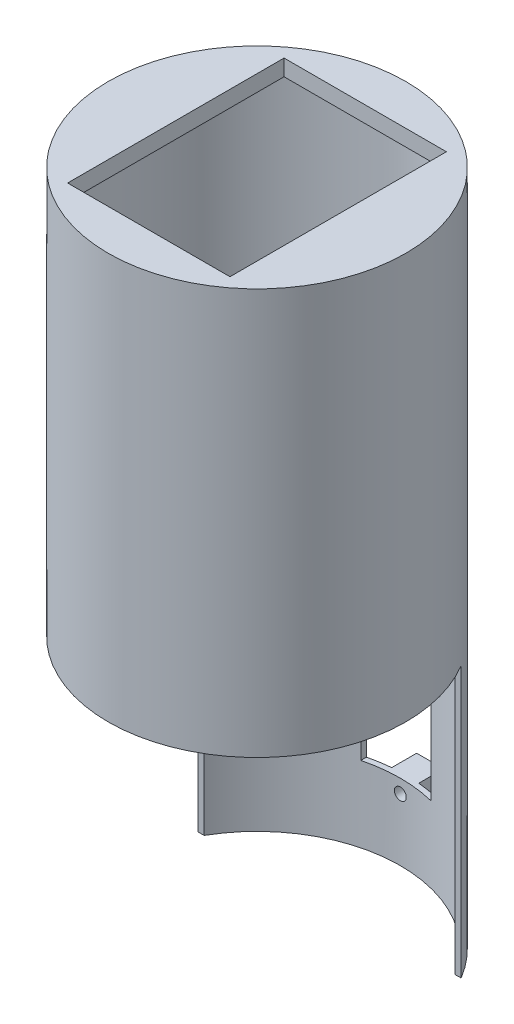
ISO-10303-21;
HEADER;
FILE_DESCRIPTION(('STEP AP214'),'2;1');
FILE_NAME('part.step','',(''),(''),'','','');
FILE_SCHEMA(('AUTOMOTIVE_DESIGN { 1 0 10303 214 1 1 1 1 }'));
ENDSEC;
DATA;
#1=APPLICATION_CONTEXT('core data for automotive mechanical design processes');
#2=APPLICATION_PROTOCOL_DEFINITION('international standard','automotive_design',2000,#1);
#3=PRODUCT_CONTEXT('',#1,'mechanical');
#4=PRODUCT('Part','Part','',(#3));
#5=PRODUCT_RELATED_PRODUCT_CATEGORY('part','',(#4));
#6=PRODUCT_DEFINITION_FORMATION('','',#4);
#7=PRODUCT_DEFINITION_CONTEXT('part definition',#1,'design');
#8=PRODUCT_DEFINITION('design','',#6,#7);
#9=PRODUCT_DEFINITION_SHAPE('','',#8);
#10=(LENGTH_UNIT() NAMED_UNIT(*) SI_UNIT(.MILLI.,.METRE.));
#11=(NAMED_UNIT(*) PLANE_ANGLE_UNIT() SI_UNIT($,.RADIAN.));
#12=(NAMED_UNIT(*) SI_UNIT($,.STERADIAN.) SOLID_ANGLE_UNIT());
#13=UNCERTAINTY_MEASURE_WITH_UNIT(LENGTH_MEASURE(1.E-05),#10,'distance_accuracy_value','');
#14=(GEOMETRIC_REPRESENTATION_CONTEXT(3) GLOBAL_UNCERTAINTY_ASSIGNED_CONTEXT((#13)) GLOBAL_UNIT_ASSIGNED_CONTEXT((#10,
#11,#12)) REPRESENTATION_CONTEXT('',''));
#15=CARTESIAN_POINT('',(0.,0.,0.));
#16=DIRECTION('',(0.,0.,1.));
#17=DIRECTION('',(1.,0.,0.));
#18=AXIS2_PLACEMENT_3D('',#15,#16,#17);
#19=CARTESIAN_POINT('',(0.,72.,0.));
#20=DIRECTION('',(0.,-1.,0.));
#21=DIRECTION('',(0.,0.,-1.));
#22=AXIS2_PLACEMENT_3D('',#19,#20,#21);
#23=CYLINDRICAL_SURFACE('',#22,26.5);
#24=CARTESIAN_POINT('',(0.,-37.4,-26.5));
#25=CARTESIAN_POINT('',(0.0617589452511682,-37.400002729874,-26.4999996935097));
#26=CARTESIAN_POINT('',(0.123561993971277,-37.4052186008234,-26.4997817896325));
#27=CARTESIAN_POINT('',(0.245464046329812,-37.4259522688252,-26.4989334760006));
#28=CARTESIAN_POINT('',(0.305560940466861,-37.4414822853654,-26.4983025769705));
#29=CARTESIAN_POINT('',(0.42226711536408,-37.4823996245956,-26.4966996998624));
#30=CARTESIAN_POINT('',(0.478878122595801,-37.5077820214064,-26.4957278922513));
#31=CARTESIAN_POINT('',(0.58702020754125,-37.5676762799759,-26.493552728907));
#32=CARTESIAN_POINT('',(0.63855250020232,-37.6021859509648,-26.4923494287566));
#33=CARTESIAN_POINT('',(0.735128130234891,-37.6793840891992,-26.4898457082133));
#34=CARTESIAN_POINT('',(0.780167280579122,-37.722077792857,-26.488545225967));
#35=CARTESIAN_POINT('',(0.862442587657996,-37.8144220121372,-26.4859942512746));
#36=CARTESIAN_POINT('',(0.899678429561922,-37.8640728083143,-26.4847437608471));
#37=CARTESIAN_POINT('',(0.965300190122572,-37.9689418667837,-26.4824333845427));
#38=CARTESIAN_POINT('',(0.993683064961024,-38.0241620353157,-26.4813735642748));
#39=CARTESIAN_POINT('',(1.04077360920892,-38.1385888733586,-26.4795647397747));
#40=CARTESIAN_POINT('',(1.05948133520139,-38.1977955195531,-26.4788157337248));
#41=CARTESIAN_POINT('',(1.08668008896793,-38.3184781707368,-26.4777135250847));
#42=CARTESIAN_POINT('',(1.09517705293619,-38.3799528357271,-26.4773600925296));
#43=CARTESIAN_POINT('',(1.1017313913574,-38.5034569099977,-26.4770881936496));
#44=CARTESIAN_POINT('',(1.09978882841531,-38.565486315949,-26.4771697247162));
#45=CARTESIAN_POINT('',(1.08552422122965,-38.6882987830435,-26.477758345072));
#46=CARTESIAN_POINT('',(1.0732085885059,-38.7490825903157,-26.4782651714883));
#47=CARTESIAN_POINT('',(1.03855736648415,-38.86771928334,-26.4796468394353));
#48=CARTESIAN_POINT('',(1.01622174467526,-38.9255721595816,-26.4805216821599));
#49=CARTESIAN_POINT('',(0.962157227961625,-39.0367254248538,-26.4825410751846));
#50=CARTESIAN_POINT('',(0.93042540211936,-39.0900243866974,-26.4836857096173));
#51=CARTESIAN_POINT('',(0.858471375818803,-39.1905412375027,-26.4861155767911));
#52=CARTESIAN_POINT('',(0.818249135106527,-39.2377590976315,-26.4874008101987));
#53=CARTESIAN_POINT('',(0.730419819272742,-39.3248107318108,-26.4899681737725));
#54=CARTESIAN_POINT('',(0.682807189316175,-39.3646389017085,-26.4912503008616));
#55=CARTESIAN_POINT('',(0.581568197107877,-39.4357374151223,-26.4936659950437));
#56=CARTESIAN_POINT('',(0.527941833648771,-39.4670077569203,-26.4947995621069));
#57=CARTESIAN_POINT('',(0.416194427191349,-39.5201023862191,-26.4967904000826));
#58=CARTESIAN_POINT('',(0.358073295597417,-39.5419264874706,-26.4976476655472));
#59=CARTESIAN_POINT('',(0.238987625302625,-39.575505508305,-26.4989891924384));
#60=CARTESIAN_POINT('',(0.178023101309435,-39.5872604799651,-26.499473455794));
#61=CARTESIAN_POINT('',(0.0550298784261445,-39.6003606734211,-26.5000141484473));
#62=CARTESIAN_POINT('',(-0.00699799332828351,-39.6017136483519,-26.5000708963932));
#63=CARTESIAN_POINT('',(-0.130399938440259,-39.5939916616444,-26.4997510071601));
#64=CARTESIAN_POINT('',(-0.191774013276864,-39.5849167236019,-26.4993743709619));
#65=CARTESIAN_POINT('',(-0.312104509942988,-39.5566029317541,-26.4982303525802));
#66=CARTESIAN_POINT('',(-0.371061763908485,-39.5373676084913,-26.4974631061298));
#67=CARTESIAN_POINT('',(-0.484910635149474,-39.489282645512,-26.4956242850852));
#68=CARTESIAN_POINT('',(-0.539802236386338,-39.4604329678703,-26.4945527092904));
#69=CARTESIAN_POINT('',(-0.643997275948345,-39.3939183246131,-26.4922250632869));
#70=CARTESIAN_POINT('',(-0.693297387515015,-39.3562481515009,-26.4909688842548));
#71=CARTESIAN_POINT('',(-0.784876568130034,-39.2731694612838,-26.4884139147118));
#72=CARTESIAN_POINT('',(-0.827155605334666,-39.2277609090837,-26.4871151240076));
#73=CARTESIAN_POINT('',(-0.903518495262748,-39.1304611489397,-26.4846204258453));
#74=CARTESIAN_POINT('',(-0.937597338739963,-39.0785660077966,-26.4834245815588));
#75=CARTESIAN_POINT('',(-0.996558236576193,-38.9697861326951,-26.4812716057593));
#76=CARTESIAN_POINT('',(-1.02144032162586,-38.9129014153883,-26.4803144734497));
#77=CARTESIAN_POINT('',(-1.06129263000982,-38.7957758401972,-26.4787472955277));
#78=CARTESIAN_POINT('',(-1.07626606958462,-38.7355360782144,-26.4781371373004));
#79=CARTESIAN_POINT('',(-1.09588657499042,-38.613394987565,-26.4773323903578));
#80=CARTESIAN_POINT('',(-1.10053367534403,-38.5514936644539,-26.4771378002532));
#81=CARTESIAN_POINT('',(-1.09936922290695,-38.4278365411004,-26.4771861708679));
#82=CARTESIAN_POINT('',(-1.09356555622664,-38.366080666311,-26.477428801662));
#83=CARTESIAN_POINT('',(-1.07168058358528,-38.2444207405855,-26.4783235691534));
#84=CARTESIAN_POINT('',(-1.05559925761295,-38.1845166932553,-26.4789757066481));
#85=CARTESIAN_POINT('',(-1.0136169125498,-38.0682588149494,-26.4806159122557));
#86=CARTESIAN_POINT('',(-0.987715767412534,-38.0119050295555,-26.4816039846806));
#87=CARTESIAN_POINT('',(-0.926830729906343,-37.9043460559767,-26.4838046488444));
#88=CARTESIAN_POINT('',(-0.891847140341158,-37.8531406962251,-26.4850172330978));
#89=CARTESIAN_POINT('',(-0.813763279050128,-37.7572935086035,-26.4875312528147));
#90=CARTESIAN_POINT('',(-0.770657771620059,-37.7126559478334,-26.488832745245));
#91=CARTESIAN_POINT('',(-0.677552216032354,-37.6312378262275,-26.4913775962537));
#92=CARTESIAN_POINT('',(-0.627550469067919,-37.5944592070573,-26.4926209404066));
#93=CARTESIAN_POINT('',(-0.522042169506855,-37.5297911373272,-26.4949100151325));
#94=CARTESIAN_POINT('',(-0.466531208929122,-37.5019088812536,-26.4959555854891));
#95=CARTESIAN_POINT('',(-0.351653793480972,-37.4558929606169,-26.4977286923102));
#96=CARTESIAN_POINT('',(-0.292292008089312,-37.4377477278389,-26.4984566059784));
#97=CARTESIAN_POINT('',(-0.193798651151999,-37.4165043568532,-26.499318867318));
#98=CARTESIAN_POINT('',(-0.155305708091902,-37.4103230691268,-26.4995731764785));
#99=CARTESIAN_POINT('',(-0.077881023756094,-37.4020700310647,-26.4999138394177));
#100=CARTESIAN_POINT('',(-0.0389492827332718,-37.3999982783606,-26.5000001932931));
#101=CARTESIAN_POINT('',(0.,-37.4,-26.5));
#102=B_SPLINE_CURVE_WITH_KNOTS('',3,(#24,#25,#26,#27,#28,#29,#30,#31,#32,#33,#34,#35,#36,#37,
#38,#39,#40,#41,#42,#43,#44,#45,#46,#47,#48,#49,#50,#51,#52,#53,#54,#55,#56,#57,#58,#59,#60,#61,
#62,#63,#64,#65,#66,#67,#68,#69,#70,#71,#72,#73,#74,#75,#76,#77,#78,#79,#80,#81,#82,#83,#84,#85,
#86,#87,#88,#89,#90,#91,#92,#93,#94,#95,#96,#97,#98,#99,#100,#101),.UNSPECIFIED.,.T.,.F.,(4,2,2,
2,2,2,2,2,2,2,2,2,2,2,2,2,2,2,2,2,2,2,2,2,2,2,2,2,2,2,2,2,2,2,2,2,2,2,4),(0.,0.185134660976402,
0.370489048915192,0.55575088462896,0.740968293249063,0.926304608004473,1.11164839886264,
1.29705584437244,1.48246220555455,1.66776072547565,1.85305813417818,2.03824109586141,
2.22342465839404,2.40866604579156,2.59390831145849,2.77929049100162,2.96467270776396,
3.15005857949574,3.33544349241097,3.52069021515502,3.70593651873387,3.89111849501781,
4.07630120178878,4.2615935147255,4.44688666802293,4.63229272548035,4.81769816421054,
5.00304339275786,5.18838800166532,5.37359280881638,5.55879797657435,5.74400552169193,
5.9292068928838,6.11452806309755,6.29989496679362,6.48541139892349,6.67070693477096,
6.78746518542354,6.90422336878912),.UNSPECIFIED.);
#103=CARTESIAN_POINT('',(0.,-37.4,-26.5));
#104=VERTEX_POINT('',#103);
#105=EDGE_CURVE('E406',#104,#104,#102,.T.);
#106=ORIENTED_EDGE('',*,*,#105,.T.);
#107=EDGE_LOOP('',(#106));
#108=FACE_BOUND('',#107,.T.);
#109=DIRECTION('',(0.,-1.,0.));
#110=VECTOR('',#109,1.);
#111=CARTESIAN_POINT('',(-6.50000000000001,72.,-25.6904651573303));
#112=LINE('',#111,#110);
#113=CARTESIAN_POINT('',(-6.5,-12.5,-25.6904651573303));
#114=VERTEX_POINT('',#113);
#115=CARTESIAN_POINT('',(-6.49999999999999,-36.,-25.6904651573303));
#116=VERTEX_POINT('',#115);
#117=EDGE_CURVE('E397',#114,#116,#112,.T.);
#118=ORIENTED_EDGE('',*,*,#117,.F.);
#119=CARTESIAN_POINT('',(0.,-12.5,0.));
#120=DIRECTION('',(0.,1.,0.));
#121=DIRECTION('',(0.,0.,1.));
#122=AXIS2_PLACEMENT_3D('',#119,#120,#121);
#123=CIRCLE('',#122,26.5);
#124=CARTESIAN_POINT('',(6.5,-12.5,-25.6904651573303));
#125=VERTEX_POINT('',#124);
#126=EDGE_CURVE('E394',#125,#114,#123,.T.);
#127=ORIENTED_EDGE('',*,*,#126,.F.);
#128=DIRECTION('',(0.,-1.,0.));
#129=VECTOR('',#128,1.);
#130=CARTESIAN_POINT('',(6.49999999999999,72.,-25.6904651573303));
#131=LINE('',#130,#129);
#132=CARTESIAN_POINT('',(6.50000000000001,-36.,-25.6904651573303));
#133=VERTEX_POINT('',#132);
#134=EDGE_CURVE('E391',#133,#125,#131,.F.);
#135=ORIENTED_EDGE('',*,*,#134,.F.);
#136=CARTESIAN_POINT('',(0.,-36.,0.));
#137=DIRECTION('',(0.,-1.,0.));
#138=DIRECTION('',(0.,0.,-1.));
#139=AXIS2_PLACEMENT_3D('',#136,#137,#138);
#140=CIRCLE('',#139,26.5);
#141=EDGE_CURVE('E388',#116,#133,#140,.T.);
#142=ORIENTED_EDGE('',*,*,#141,.F.);
#143=EDGE_LOOP('',(#118,#127,#135,#142));
#144=FACE_BOUND('',#143,.T.);
#145=CARTESIAN_POINT('',(0.,72.,0.));
#146=DIRECTION('',(0.,1.,0.));
#147=DIRECTION('',(0.,0.,1.));
#148=AXIS2_PLACEMENT_3D('',#145,#146,#147);
#149=CIRCLE('',#148,26.5);
#150=CARTESIAN_POINT('',(0.,72.,26.5));
#151=VERTEX_POINT('',#150);
#152=EDGE_CURVE('E299',#151,#151,#149,.T.);
#153=ORIENTED_EDGE('',*,*,#152,.T.);
#154=EDGE_LOOP('',(#153));
#155=FACE_BOUND('',#154,.T.);
#156=DIRECTION('',(0.,-1.,0.));
#157=VECTOR('',#156,1.);
#158=CARTESIAN_POINT('',(22.4286393936571,72.,-14.1140403481531));
#159=LINE('',#158,#157);
#160=CARTESIAN_POINT('',(22.4286393936571,-50.,-14.1140403481531));
#161=VERTEX_POINT('',#160);
#162=CARTESIAN_POINT('',(22.4286393936571,0.,-14.1140403481531));
#163=VERTEX_POINT('',#162);
#164=EDGE_CURVE('E381',#161,#163,#159,.F.);
#165=ORIENTED_EDGE('',*,*,#164,.T.);
#166=CARTESIAN_POINT('',(0.,0.,0.));
#167=DIRECTION('',(0.,1.,0.));
#168=DIRECTION('',(0.,0.,1.));
#169=AXIS2_PLACEMENT_3D('',#166,#167,#168);
#170=CIRCLE('',#169,26.5);
#171=CARTESIAN_POINT('',(-22.9727190697394,0.,-13.2100029728547));
#172=VERTEX_POINT('',#171);
#173=EDGE_CURVE('E303',#163,#172,#170,.F.);
#174=ORIENTED_EDGE('',*,*,#173,.T.);
#175=DIRECTION('',(0.,-1.,0.));
#176=VECTOR('',#175,1.);
#177=CARTESIAN_POINT('',(-22.9727190697394,72.,-13.2100029728547));
#178=LINE('',#177,#176);
#179=CARTESIAN_POINT('',(-22.9727190697394,-50.,-13.2100029728547));
#180=VERTEX_POINT('',#179);
#181=EDGE_CURVE('E378',#172,#180,#178,.T.);
#182=ORIENTED_EDGE('',*,*,#181,.T.);
#183=CARTESIAN_POINT('',(0.,-50.,0.));
#184=DIRECTION('',(0.,1.,0.));
#185=DIRECTION('',(0.,0.,1.));
#186=AXIS2_PLACEMENT_3D('',#183,#184,#185);
#187=CIRCLE('',#186,26.5);
#188=EDGE_CURVE('E306',#180,#161,#187,.F.);
#189=ORIENTED_EDGE('',*,*,#188,.T.);
#190=EDGE_LOOP('',(#165,#174,#182,#189));
#191=FACE_BOUND('',#190,.T.);
#192=CARTESIAN_POINT('',(0.,-8.9,-26.5));
#193=CARTESIAN_POINT('',(0.0617589452511677,-8.90000272987394,-26.4999996935097));
#194=CARTESIAN_POINT('',(0.123561993971276,-8.90521860082336,-26.4997817896325));
#195=CARTESIAN_POINT('',(0.245464046329811,-8.92595226882521,-26.4989334760006));
#196=CARTESIAN_POINT('',(0.30556094046686,-8.94148228536538,-26.4983025769705));
#197=CARTESIAN_POINT('',(0.422267115364079,-8.98239962459555,-26.4966996998624));
#198=CARTESIAN_POINT('',(0.478878122595798,-9.00778202140638,-26.4957278922513));
#199=CARTESIAN_POINT('',(0.587020207541248,-9.06767627997587,-26.493552728907));
#200=CARTESIAN_POINT('',(0.638552500202319,-9.10218595096482,-26.4923494287566));
#201=CARTESIAN_POINT('',(0.73512813023489,-9.17938408919918,-26.4898457082133));
#202=CARTESIAN_POINT('',(0.780167280579121,-9.22207779285701,-26.488545225967));
#203=CARTESIAN_POINT('',(0.862442587657994,-9.31442201213722,-26.4859942512746));
#204=CARTESIAN_POINT('',(0.899678429561921,-9.36407280831426,-26.4847437608471));
#205=CARTESIAN_POINT('',(0.965300190122571,-9.4689418667837,-26.4824333845427));
#206=CARTESIAN_POINT('',(0.993683064961022,-9.52416203531568,-26.4813735642748));
#207=CARTESIAN_POINT('',(1.04077360920892,-9.63858887335856,-26.4795647397747));
#208=CARTESIAN_POINT('',(1.05948133520139,-9.69779551955312,-26.4788157337248));
#209=CARTESIAN_POINT('',(1.08668008896793,-9.81847817073677,-26.4777135250847));
#210=CARTESIAN_POINT('',(1.09517705293619,-9.87995283572712,-26.4773600925296));
#211=CARTESIAN_POINT('',(1.10173139135739,-10.0034569099977,-26.4770881936496));
#212=CARTESIAN_POINT('',(1.09978882841531,-10.065486315949,-26.4771697247162));
#213=CARTESIAN_POINT('',(1.08552422122965,-10.1882987830435,-26.477758345072));
#214=CARTESIAN_POINT('',(1.0732085885059,-10.2490825903157,-26.4782651714883));
#215=CARTESIAN_POINT('',(1.03855736648414,-10.36771928334,-26.4796468394353));
#216=CARTESIAN_POINT('',(1.01622174467526,-10.4255721595816,-26.4805216821599));
#217=CARTESIAN_POINT('',(0.962157227961623,-10.5367254248538,-26.4825410751846));
#218=CARTESIAN_POINT('',(0.930425402119359,-10.5900243866974,-26.4836857096173));
#219=CARTESIAN_POINT('',(0.858471375818802,-10.6905412375027,-26.4861155767911));
#220=CARTESIAN_POINT('',(0.818249135106522,-10.7377590976315,-26.4874008101987));
#221=CARTESIAN_POINT('',(0.730419819272735,-10.8248107318108,-26.4899681737725));
#222=CARTESIAN_POINT('',(0.682807189316169,-10.8646389017085,-26.4912503008616));
#223=CARTESIAN_POINT('',(0.581568197107872,-10.9357374151223,-26.4936659950437));
#224=CARTESIAN_POINT('',(0.527941833648765,-10.9670077569203,-26.4947995621069));
#225=CARTESIAN_POINT('',(0.416194427191344,-11.0201023862191,-26.4967904000826));
#226=CARTESIAN_POINT('',(0.358073295597412,-11.0419264874706,-26.4976476655472));
#227=CARTESIAN_POINT('',(0.23898762530262,-11.075505508305,-26.4989891924384));
#228=CARTESIAN_POINT('',(0.17802310130943,-11.0872604799651,-26.499473455794));
#229=CARTESIAN_POINT('',(0.0550298784261389,-11.1003606734211,-26.5000141484473));
#230=CARTESIAN_POINT('',(-0.00699799332828929,-11.1017136483519,-26.5000708963932));
#231=CARTESIAN_POINT('',(-0.130399938440265,-11.0939916616444,-26.4997510071601));
#232=CARTESIAN_POINT('',(-0.19177401327687,-11.0849167236019,-26.4993743709619));
#233=CARTESIAN_POINT('',(-0.312104509942995,-11.0566029317541,-26.4982303525802));
#234=CARTESIAN_POINT('',(-0.371061763908493,-11.0373676084912,-26.4974631061298));
#235=CARTESIAN_POINT('',(-0.484910635149482,-10.989282645512,-26.4956242850852));
#236=CARTESIAN_POINT('',(-0.539802236386345,-10.9604329678703,-26.4945527092904));
#237=CARTESIAN_POINT('',(-0.64399727594835,-10.8939183246131,-26.4922250632869));
#238=CARTESIAN_POINT('',(-0.693297387515018,-10.8562481515009,-26.4909688842548));
#239=CARTESIAN_POINT('',(-0.784876568130038,-10.7731694612838,-26.4884139147118));
#240=CARTESIAN_POINT('',(-0.827155605334671,-10.7277609090837,-26.4871151240076));
#241=CARTESIAN_POINT('',(-0.903518495262754,-10.6304611489397,-26.4846204258453));
#242=CARTESIAN_POINT('',(-0.93759733873997,-10.5785660077966,-26.4834245815588));
#243=CARTESIAN_POINT('',(-0.996558236576198,-10.4697861326951,-26.4812716057593));
#244=CARTESIAN_POINT('',(-1.02144032162587,-10.4129014153883,-26.4803144734497));
#245=CARTESIAN_POINT('',(-1.06129263000983,-10.2957758401972,-26.4787472955277));
#246=CARTESIAN_POINT('',(-1.07626606958462,-10.2355360782144,-26.4781371373004));
#247=CARTESIAN_POINT('',(-1.09588657499042,-10.113394987565,-26.4773323903578));
#248=CARTESIAN_POINT('',(-1.10053367534404,-10.0514936644539,-26.4771378002532));
#249=CARTESIAN_POINT('',(-1.09936922290696,-9.9278365411004,-26.4771861708679));
#250=CARTESIAN_POINT('',(-1.09356555622665,-9.86608066631101,-26.477428801662));
#251=CARTESIAN_POINT('',(-1.07168058358528,-9.74442074058553,-26.4783235691534));
#252=CARTESIAN_POINT('',(-1.05559925761296,-9.6845166932553,-26.4789757066481));
#253=CARTESIAN_POINT('',(-1.0136169125498,-9.56825881494941,-26.4806159122557));
#254=CARTESIAN_POINT('',(-0.987715767412537,-9.51190502955546,-26.4816039846806));
#255=CARTESIAN_POINT('',(-0.926830729906343,-9.40434605597669,-26.4838046488444));
#256=CARTESIAN_POINT('',(-0.891847140341156,-9.35314069622511,-26.4850172330978));
#257=CARTESIAN_POINT('',(-0.813763279050127,-9.25729350860351,-26.4875312528147));
#258=CARTESIAN_POINT('',(-0.770657771620061,-9.2126559478334,-26.488832745245));
#259=CARTESIAN_POINT('',(-0.677552216032358,-9.13123782622745,-26.4913775962537));
#260=CARTESIAN_POINT('',(-0.627550469067923,-9.09445920705726,-26.4926209404066));
#261=CARTESIAN_POINT('',(-0.522042169506859,-9.02979113732715,-26.4949100151325));
#262=CARTESIAN_POINT('',(-0.466531208929126,-9.00190888125357,-26.4959555854891));
#263=CARTESIAN_POINT('',(-0.351653793480976,-8.95589296061685,-26.4977286923102));
#264=CARTESIAN_POINT('',(-0.292292008089316,-8.93774772783891,-26.4984566059784));
#265=CARTESIAN_POINT('',(-0.193798651152002,-8.91650435685317,-26.499318867318));
#266=CARTESIAN_POINT('',(-0.155305708091904,-8.91032306912678,-26.4995731764785));
#267=CARTESIAN_POINT('',(-0.0778810237560947,-8.90207003106465,-26.4999138394177));
#268=CARTESIAN_POINT('',(-0.0389492827332721,-8.89999827836062,-26.5000001932931));
#269=CARTESIAN_POINT('',(0.,-8.9,-26.5));
#270=B_SPLINE_CURVE_WITH_KNOTS('',3,(#192,#193,#194,#195,#196,#197,#198,#199,#200,#201,#202,
#203,#204,#205,#206,#207,#208,#209,#210,#211,#212,#213,#214,#215,#216,#217,#218,#219,#220,#221,
#222,#223,#224,#225,#226,#227,#228,#229,#230,#231,#232,#233,#234,#235,#236,#237,#238,#239,#240,
#241,#242,#243,#244,#245,#246,#247,#248,#249,#250,#251,#252,#253,#254,#255,#256,#257,#258,#259,
#260,#261,#262,#263,#264,#265,#266,#267,#268,#269),.UNSPECIFIED.,.T.,.F.,(4,2,2,2,2,2,2,2,2,2,2,
2,2,2,2,2,2,2,2,2,2,2,2,2,2,2,2,2,2,2,2,2,2,2,2,2,2,2,4),(0.,0.185134660976402,
0.370489048915193,0.555750884628958,0.740968293249061,0.926304608004472,1.11164839886264,
1.29705584437244,1.48246220555456,1.66776072547565,1.85305813417817,2.03824109586141,
2.22342465839404,2.40866604579156,2.59390831145849,2.77929049100163,2.96467270776396,
3.15005857949574,3.33544349241097,3.52069021515502,3.70593651873387,3.89111849501782,
4.07630120178878,4.2615935147255,4.44688666802293,4.63229272548036,4.81769816421054,
5.00304339275786,5.18838800166532,5.37359280881639,5.55879797657435,5.74400552169194,
5.92920689288381,6.11452806309756,6.29989496679362,6.48541139892349,6.67070693477097,
6.78746518542354,6.90422336878912),.UNSPECIFIED.);
#271=CARTESIAN_POINT('',(0.,-8.9,-26.5));
#272=VERTEX_POINT('',#271);
#273=EDGE_CURVE('E205',#272,#272,#270,.T.);
#274=ORIENTED_EDGE('',*,*,#273,.T.);
#275=EDGE_LOOP('',(#274));
#276=FACE_BOUND('',#275,.T.);
#277=ADVANCED_FACE('F39',(#108,#144,#155,#191,#276),#23,.F.);
#278=CARTESIAN_POINT('',(0.,-50.,0.));
#279=DIRECTION('',(0.,1.,0.));
#280=DIRECTION('',(0.,0.,1.));
#281=AXIS2_PLACEMENT_3D('',#278,#279,#280);
#282=CYLINDRICAL_SURFACE('',#281,27.5);
#283=DIRECTION('',(0.,1.,0.));
#284=VECTOR('',#283,1.);
#285=CARTESIAN_POINT('',(-24.1320363901435,-54.,-13.186918505276));
#286=LINE('',#285,#284);
#287=CARTESIAN_POINT('',(-24.1320363901435,-50.,-13.186918505276));
#288=VERTEX_POINT('',#287);
#289=CARTESIAN_POINT('',(-24.1320363901435,0.,-13.186918505276));
#290=VERTEX_POINT('',#289);
#291=EDGE_CURVE('E331',#288,#290,#286,.T.);
#292=ORIENTED_EDGE('',*,*,#291,.T.);
#293=CARTESIAN_POINT('',(0.,0.,0.));
#294=DIRECTION('',(0.,1.,0.));
#295=DIRECTION('',(0.,0.,1.));
#296=AXIS2_PLACEMENT_3D('',#293,#294,#295);
#297=CIRCLE('',#296,27.5);
#298=CARTESIAN_POINT('',(23.5879567140611,0.,-14.1371248157317));
#299=VERTEX_POINT('',#298);
#300=EDGE_CURVE('E321',#290,#299,#297,.T.);
#301=ORIENTED_EDGE('',*,*,#300,.T.);
#302=DIRECTION('',(0.,1.,0.));
#303=VECTOR('',#302,1.);
#304=CARTESIAN_POINT('',(23.5879567140611,-54.,-14.1371248157317));
#305=LINE('',#304,#303);
#306=CARTESIAN_POINT('',(23.5879567140611,-50.,-14.1371248157317));
#307=VERTEX_POINT('',#306);
#308=EDGE_CURVE('E330',#307,#299,#305,.T.);
#309=ORIENTED_EDGE('',*,*,#308,.F.);
#310=CARTESIAN_POINT('',(0.,-50.,0.));
#311=DIRECTION('',(0.,1.,0.));
#312=DIRECTION('',(0.,0.,1.));
#313=AXIS2_PLACEMENT_3D('',#310,#311,#312);
#314=CIRCLE('',#313,27.5);
#315=EDGE_CURVE('E374',#307,#288,#314,.T.);
#316=ORIENTED_EDGE('',*,*,#315,.T.);
#317=EDGE_LOOP('',(#292,#301,#309,#316));
#318=FACE_BOUND('',#317,.T.);
#319=CARTESIAN_POINT('',(0.,75.,0.));
#320=DIRECTION('',(0.,1.,0.));
#321=DIRECTION('',(0.,0.,1.));
#322=AXIS2_PLACEMENT_3D('',#319,#320,#321);
#323=CIRCLE('',#322,27.5);
#324=CARTESIAN_POINT('',(0.,75.,27.5));
#325=VERTEX_POINT('',#324);
#326=EDGE_CURVE('E362',#325,#325,#323,.T.);
#327=ORIENTED_EDGE('',*,*,#326,.F.);
#328=EDGE_LOOP('',(#327));
#329=FACE_BOUND('',#328,.T.);
#330=CARTESIAN_POINT('',(0.,-41.,0.));
#331=DIRECTION('',(0.,1.,0.));
#332=DIRECTION('',(0.,0.,1.));
#333=AXIS2_PLACEMENT_3D('',#330,#331,#332);
#334=CIRCLE('',#333,27.5);
#335=CARTESIAN_POINT('',(-2.5,-41.,-27.3861278752583));
#336=VERTEX_POINT('',#335);
#337=CARTESIAN_POINT('',(2.5,-41.,-27.3861278752583));
#338=VERTEX_POINT('',#337);
#339=EDGE_CURVE('E11',#336,#338,#334,.F.);
#340=ORIENTED_EDGE('',*,*,#339,.T.);
#341=DIRECTION('',(0.,1.,0.));
#342=VECTOR('',#341,1.);
#343=CARTESIAN_POINT('',(2.5,-50.,-27.3861278752583));
#344=LINE('',#343,#342);
#345=CARTESIAN_POINT('',(2.5,-36.,-27.3861278752583));
#346=VERTEX_POINT('',#345);
#347=EDGE_CURVE('E232',#338,#346,#344,.T.);
#348=ORIENTED_EDGE('',*,*,#347,.T.);
#349=CARTESIAN_POINT('',(0.,-36.,0.));
#350=DIRECTION('',(0.,-1.,0.));
#351=DIRECTION('',(0.,0.,-1.));
#352=AXIS2_PLACEMENT_3D('',#349,#350,#351);
#353=CIRCLE('',#352,27.5);
#354=CARTESIAN_POINT('',(6.50000000000001,-36.,-26.7207784317748));
#355=VERTEX_POINT('',#354);
#356=EDGE_CURVE('E185',#355,#346,#353,.F.);
#357=ORIENTED_EDGE('',*,*,#356,.F.);
#358=DIRECTION('',(0.,1.,0.));
#359=VECTOR('',#358,1.);
#360=CARTESIAN_POINT('',(6.50000000000001,-50.,-26.7207784317748));
#361=LINE('',#360,#359);
#362=CARTESIAN_POINT('',(6.5,-12.5,-26.7207784317748));
#363=VERTEX_POINT('',#362);
#364=EDGE_CURVE('E287',#363,#355,#361,.F.);
#365=ORIENTED_EDGE('',*,*,#364,.F.);
#366=CARTESIAN_POINT('',(0.,-12.5,0.));
#367=DIRECTION('',(0.,1.,0.));
#368=DIRECTION('',(0.,0.,1.));
#369=AXIS2_PLACEMENT_3D('',#366,#367,#368);
#370=CIRCLE('',#369,27.5);
#371=CARTESIAN_POINT('',(2.5,-12.5,-27.3861278752583));
#372=VERTEX_POINT('',#371);
#373=EDGE_CURVE('E291',#372,#363,#370,.F.);
#374=ORIENTED_EDGE('',*,*,#373,.F.);
#375=DIRECTION('',(0.,1.,0.));
#376=VECTOR('',#375,1.);
#377=CARTESIAN_POINT('',(2.5,-50.,-27.3861278752583));
#378=LINE('',#377,#376);
#379=CARTESIAN_POINT('',(2.5,-7.50000000000001,-27.3861278752583));
#380=VERTEX_POINT('',#379);
#381=EDGE_CURVE('E265',#372,#380,#378,.T.);
#382=ORIENTED_EDGE('',*,*,#381,.T.);
#383=CARTESIAN_POINT('',(0.,-7.50000000000001,0.));
#384=DIRECTION('',(0.,-1.,0.));
#385=DIRECTION('',(0.,0.,-1.));
#386=AXIS2_PLACEMENT_3D('',#383,#384,#385);
#387=CIRCLE('',#386,27.5);
#388=CARTESIAN_POINT('',(-2.5,-7.5,-27.3861278752583));
#389=VERTEX_POINT('',#388);
#390=EDGE_CURVE('E49',#380,#389,#387,.F.);
#391=ORIENTED_EDGE('',*,*,#390,.T.);
#392=DIRECTION('',(0.,1.,0.));
#393=VECTOR('',#392,1.);
#394=CARTESIAN_POINT('',(-2.49999999999999,-50.,-27.3861278752583));
#395=LINE('',#394,#393);
#396=CARTESIAN_POINT('',(-2.5,-12.5,-27.3861278752583));
#397=VERTEX_POINT('',#396);
#398=EDGE_CURVE('E261',#389,#397,#395,.F.);
#399=ORIENTED_EDGE('',*,*,#398,.T.);
#400=CARTESIAN_POINT('',(-6.5,-12.5,-26.7207784317748));
#401=VERTEX_POINT('',#400);
#402=EDGE_CURVE('E292',#401,#397,#370,.F.);
#403=ORIENTED_EDGE('',*,*,#402,.F.);
#404=DIRECTION('',(0.,1.,0.));
#405=VECTOR('',#404,1.);
#406=CARTESIAN_POINT('',(-6.49999999999999,-50.,-26.7207784317748));
#407=LINE('',#406,#405);
#408=CARTESIAN_POINT('',(-6.49999999999999,-36.,-26.7207784317748));
#409=VERTEX_POINT('',#408);
#410=EDGE_CURVE('E296',#409,#401,#407,.T.);
#411=ORIENTED_EDGE('',*,*,#410,.F.);
#412=CARTESIAN_POINT('',(-2.5,-36.,-27.3861278752583));
#413=VERTEX_POINT('',#412);
#414=EDGE_CURVE('E274',#413,#409,#353,.F.);
#415=ORIENTED_EDGE('',*,*,#414,.F.);
#416=DIRECTION('',(0.,1.,0.));
#417=VECTOR('',#416,1.);
#418=CARTESIAN_POINT('',(-2.5,-50.,-27.3861278752583));
#419=LINE('',#418,#417);
#420=EDGE_CURVE('E190',#413,#336,#419,.F.);
#421=ORIENTED_EDGE('',*,*,#420,.T.);
#422=EDGE_LOOP('',(#340,#348,#357,#365,#374,#382,#391,#399,#403,#411,#415,#421));
#423=FACE_BOUND('',#422,.T.);
#424=ADVANCED_FACE('F41',(#318,#329,#423),#282,.T.);
#425=CARTESIAN_POINT('',(23.5879567140611,-54.,-14.1371248157317));
#426=DIRECTION('',(-0.0199081753741811,0.,-0.99980181263752));
#427=DIRECTION('',(-0.99980181263752,0.,0.0199081753741811));
#428=AXIS2_PLACEMENT_3D('',#425,#426,#427);
#429=PLANE('',#428);
#430=ORIENTED_EDGE('',*,*,#164,.F.);
#431=DIRECTION('',(-0.99980181263752,0.,0.0199081753741811));
#432=VECTOR('',#431,1.);
#433=CARTESIAN_POINT('',(-0.272039838041163,-50.,-13.6620216605039));
#434=LINE('',#433,#432);
#435=EDGE_CURVE('E338',#307,#161,#434,.T.);
#436=ORIENTED_EDGE('',*,*,#435,.F.);
#437=ORIENTED_EDGE('',*,*,#308,.T.);
#438=DIRECTION('',(-0.99980181263752,0.,0.0199081753741811));
#439=VECTOR('',#438,1.);
#440=CARTESIAN_POINT('',(23.5879567140611,0.,-14.1371248157317));
#441=LINE('',#440,#439);
#442=EDGE_CURVE('E326',#299,#163,#441,.T.);
#443=ORIENTED_EDGE('',*,*,#442,.T.);
#444=EDGE_LOOP('',(#430,#436,#437,#443));
#445=FACE_BOUND('',#444,.T.);
#446=ADVANCED_FACE('F484',(#445),#429,.F.);
#447=ORIENTED_EDGE('',*,*,#181,.F.);
#448=EDGE_CURVE('E325',#172,#290,#441,.T.);
#449=ORIENTED_EDGE('',*,*,#448,.T.);
#450=ORIENTED_EDGE('',*,*,#291,.F.);
#451=EDGE_CURVE('E335',#180,#288,#434,.T.);
#452=ORIENTED_EDGE('',*,*,#451,.F.);
#453=EDGE_LOOP('',(#447,#449,#450,#452));
#454=FACE_BOUND('',#453,.T.);
#455=ADVANCED_FACE('F530',(#454),#429,.F.);
#456=CARTESIAN_POINT('',(0.,-50.,0.));
#457=DIRECTION('',(0.,1.,0.));
#458=DIRECTION('',(0.,0.,1.));
#459=AXIS2_PLACEMENT_3D('',#456,#457,#458);
#460=PLANE('',#459);
#461=ORIENTED_EDGE('',*,*,#188,.F.);
#462=ORIENTED_EDGE('',*,*,#451,.T.);
#463=ORIENTED_EDGE('',*,*,#315,.F.);
#464=ORIENTED_EDGE('',*,*,#435,.T.);
#465=EDGE_LOOP('',(#461,#462,#463,#464));
#466=FACE_BOUND('',#465,.T.);
#467=ADVANCED_FACE('F527',(#466),#460,.F.);
#468=CARTESIAN_POINT('',(0.,75.,0.));
#469=DIRECTION('',(0.,1.,0.));
#470=DIRECTION('',(0.,0.,1.));
#471=AXIS2_PLACEMENT_3D('',#468,#469,#470);
#472=PLANE('',#471);
#473=DIRECTION('',(-1.,0.,0.));
#474=VECTOR('',#473,1.);
#475=CARTESIAN_POINT('',(-15.,75.,-20.));
#476=LINE('',#475,#474);
#477=CARTESIAN_POINT('',(15.,75.,-20.));
#478=VERTEX_POINT('',#477);
#479=CARTESIAN_POINT('',(-15.,75.,-20.));
#480=VERTEX_POINT('',#479);
#481=EDGE_CURVE('E342',#478,#480,#476,.T.);
#482=ORIENTED_EDGE('',*,*,#481,.F.);
#483=DIRECTION('',(0.,0.,-1.));
#484=VECTOR('',#483,1.);
#485=CARTESIAN_POINT('',(15.,75.,-20.));
#486=LINE('',#485,#484);
#487=CARTESIAN_POINT('',(15.,75.,20.));
#488=VERTEX_POINT('',#487);
#489=EDGE_CURVE('E354',#488,#478,#486,.T.);
#490=ORIENTED_EDGE('',*,*,#489,.F.);
#491=DIRECTION('',(1.,0.,0.));
#492=VECTOR('',#491,1.);
#493=CARTESIAN_POINT('',(-15.,75.,20.));
#494=LINE('',#493,#492);
#495=CARTESIAN_POINT('',(-15.,75.,20.));
#496=VERTEX_POINT('',#495);
#497=EDGE_CURVE('E350',#496,#488,#494,.T.);
#498=ORIENTED_EDGE('',*,*,#497,.F.);
#499=DIRECTION('',(0.,0.,1.));
#500=VECTOR('',#499,1.);
#501=CARTESIAN_POINT('',(-15.,75.,-20.));
#502=LINE('',#501,#500);
#503=EDGE_CURVE('E346',#480,#496,#502,.T.);
#504=ORIENTED_EDGE('',*,*,#503,.F.);
#505=EDGE_LOOP('',(#482,#490,#498,#504));
#506=FACE_BOUND('',#505,.T.);
#507=ORIENTED_EDGE('',*,*,#326,.T.);
#508=EDGE_LOOP('',(#507));
#509=FACE_BOUND('',#508,.T.);
#510=ADVANCED_FACE('F557',(#506,#509),#472,.T.);
#511=CARTESIAN_POINT('',(-15.,29.9,-20.));
#512=DIRECTION('',(0.,0.,-1.));
#513=DIRECTION('',(-1.,0.,0.));
#514=AXIS2_PLACEMENT_3D('',#511,#512,#513);
#515=PLANE('',#514);
#516=DIRECTION('',(0.,1.,0.));
#517=VECTOR('',#516,1.);
#518=CARTESIAN_POINT('',(-15.,29.9,-20.));
#519=LINE('',#518,#517);
#520=CARTESIAN_POINT('',(-15.,72.,-20.));
#521=VERTEX_POINT('',#520);
#522=EDGE_CURVE('E358',#521,#480,#519,.T.);
#523=ORIENTED_EDGE('',*,*,#522,.F.);
#524=DIRECTION('',(1.,0.,0.));
#525=VECTOR('',#524,1.);
#526=CARTESIAN_POINT('',(-15.,72.,-20.));
#527=LINE('',#526,#525);
#528=CARTESIAN_POINT('',(15.,72.,-20.));
#529=VERTEX_POINT('',#528);
#530=EDGE_CURVE('E317',#521,#529,#527,.T.);
#531=ORIENTED_EDGE('',*,*,#530,.T.);
#532=DIRECTION('',(0.,1.,0.));
#533=VECTOR('',#532,1.);
#534=CARTESIAN_POINT('',(15.,29.9,-20.));
#535=LINE('',#534,#533);
#536=EDGE_CURVE('E359',#529,#478,#535,.T.);
#537=ORIENTED_EDGE('',*,*,#536,.T.);
#538=ORIENTED_EDGE('',*,*,#481,.T.);
#539=EDGE_LOOP('',(#523,#531,#537,#538));
#540=FACE_BOUND('',#539,.T.);
#541=ADVANCED_FACE('F547',(#540),#515,.F.);
#542=CARTESIAN_POINT('',(15.,29.9,-20.));
#543=DIRECTION('',(1.,0.,0.));
#544=DIRECTION('',(0.,0.,-1.));
#545=AXIS2_PLACEMENT_3D('',#542,#543,#544);
#546=PLANE('',#545);
#547=ORIENTED_EDGE('',*,*,#536,.F.);
#548=DIRECTION('',(0.,0.,1.));
#549=VECTOR('',#548,1.);
#550=CARTESIAN_POINT('',(15.,72.,-20.));
#551=LINE('',#550,#549);
#552=CARTESIAN_POINT('',(15.,72.,20.));
#553=VERTEX_POINT('',#552);
#554=EDGE_CURVE('E313',#529,#553,#551,.T.);
#555=ORIENTED_EDGE('',*,*,#554,.T.);
#556=DIRECTION('',(0.,1.,0.));
#557=VECTOR('',#556,1.);
#558=CARTESIAN_POINT('',(15.,29.9,20.));
#559=LINE('',#558,#557);
#560=EDGE_CURVE('E363',#553,#488,#559,.T.);
#561=ORIENTED_EDGE('',*,*,#560,.T.);
#562=ORIENTED_EDGE('',*,*,#489,.T.);
#563=EDGE_LOOP('',(#547,#555,#561,#562));
#564=FACE_BOUND('',#563,.T.);
#565=ADVANCED_FACE('F543',(#564),#546,.F.);
#566=CARTESIAN_POINT('',(-15.,29.9,20.));
#567=DIRECTION('',(0.,0.,1.));
#568=DIRECTION('',(1.,0.,0.));
#569=AXIS2_PLACEMENT_3D('',#566,#567,#568);
#570=PLANE('',#569);
#571=ORIENTED_EDGE('',*,*,#560,.F.);
#572=DIRECTION('',(-1.,0.,0.));
#573=VECTOR('',#572,1.);
#574=CARTESIAN_POINT('',(-15.,72.,20.));
#575=LINE('',#574,#573);
#576=CARTESIAN_POINT('',(-15.,72.,20.));
#577=VERTEX_POINT('',#576);
#578=EDGE_CURVE('E309',#553,#577,#575,.T.);
#579=ORIENTED_EDGE('',*,*,#578,.T.);
#580=DIRECTION('',(0.,1.,0.));
#581=VECTOR('',#580,1.);
#582=CARTESIAN_POINT('',(-15.,29.9,20.));
#583=LINE('',#582,#581);
#584=EDGE_CURVE('E366',#577,#496,#583,.T.);
#585=ORIENTED_EDGE('',*,*,#584,.T.);
#586=ORIENTED_EDGE('',*,*,#497,.T.);
#587=EDGE_LOOP('',(#571,#579,#585,#586));
#588=FACE_BOUND('',#587,.T.);
#589=ADVANCED_FACE('F546',(#588),#570,.F.);
#590=CARTESIAN_POINT('',(-15.,29.9,-20.));
#591=DIRECTION('',(-1.,0.,0.));
#592=DIRECTION('',(0.,0.,1.));
#593=AXIS2_PLACEMENT_3D('',#590,#591,#592);
#594=PLANE('',#593);
#595=ORIENTED_EDGE('',*,*,#584,.F.);
#596=DIRECTION('',(0.,0.,-1.));
#597=VECTOR('',#596,1.);
#598=CARTESIAN_POINT('',(-15.,72.,-20.));
#599=LINE('',#598,#597);
#600=EDGE_CURVE('E384',#577,#521,#599,.T.);
#601=ORIENTED_EDGE('',*,*,#600,.T.);
#602=ORIENTED_EDGE('',*,*,#522,.T.);
#603=ORIENTED_EDGE('',*,*,#503,.T.);
#604=EDGE_LOOP('',(#595,#601,#602,#603));
#605=FACE_BOUND('',#604,.T.);
#606=ADVANCED_FACE('F476',(#605),#594,.F.);
#607=CARTESIAN_POINT('',(0.,0.,0.));
#608=DIRECTION('',(0.,1.,0.));
#609=DIRECTION('',(0.,0.,1.));
#610=AXIS2_PLACEMENT_3D('',#607,#608,#609);
#611=PLANE('',#610);
#612=ORIENTED_EDGE('',*,*,#173,.F.);
#613=ORIENTED_EDGE('',*,*,#442,.F.);
#614=ORIENTED_EDGE('',*,*,#300,.F.);
#615=ORIENTED_EDGE('',*,*,#448,.F.);
#616=EDGE_LOOP('',(#612,#613,#614,#615));
#617=FACE_BOUND('',#616,.T.);
#618=ADVANCED_FACE('F471',(#617),#611,.F.);
#619=CARTESIAN_POINT('',(0.,72.,0.));
#620=DIRECTION('',(0.,1.,0.));
#621=DIRECTION('',(0.,0.,1.));
#622=AXIS2_PLACEMENT_3D('',#619,#620,#621);
#623=PLANE('',#622);
#624=ORIENTED_EDGE('',*,*,#152,.F.);
#625=EDGE_LOOP('',(#624));
#626=FACE_BOUND('',#625,.T.);
#627=ORIENTED_EDGE('',*,*,#600,.F.);
#628=ORIENTED_EDGE('',*,*,#578,.F.);
#629=ORIENTED_EDGE('',*,*,#554,.F.);
#630=ORIENTED_EDGE('',*,*,#530,.F.);
#631=EDGE_LOOP('',(#627,#628,#629,#630));
#632=FACE_BOUND('',#631,.T.);
#633=ADVANCED_FACE('F468',(#626,#632),#623,.F.);
#634=CARTESIAN_POINT('',(-6.5,-12.5,-54.));
#635=DIRECTION('',(-1.,0.,0.));
#636=DIRECTION('',(0.,-1.,0.));
#637=AXIS2_PLACEMENT_3D('',#634,#635,#636);
#638=PLANE('',#637);
#639=ORIENTED_EDGE('',*,*,#410,.T.);
#640=DIRECTION('',(0.,0.,1.));
#641=VECTOR('',#640,1.);
#642=CARTESIAN_POINT('',(-6.5,-12.5,-54.));
#643=LINE('',#642,#641);
#644=EDGE_CURVE('E270',#401,#114,#643,.T.);
#645=ORIENTED_EDGE('',*,*,#644,.T.);
#646=ORIENTED_EDGE('',*,*,#117,.T.);
#647=DIRECTION('',(0.,0.,1.));
#648=VECTOR('',#647,1.);
#649=CARTESIAN_POINT('',(-6.49999999999999,-36.,-54.));
#650=LINE('',#649,#648);
#651=EDGE_CURVE('E269',#409,#116,#650,.T.);
#652=ORIENTED_EDGE('',*,*,#651,.F.);
#653=EDGE_LOOP('',(#639,#645,#646,#652));
#654=FACE_BOUND('',#653,.T.);
#655=ADVANCED_FACE('F461',(#654),#638,.F.);
#656=CARTESIAN_POINT('',(-6.5,-12.5,-54.));
#657=DIRECTION('',(0.,1.,0.));
#658=DIRECTION('',(0.,0.,1.));
#659=AXIS2_PLACEMENT_3D('',#656,#657,#658);
#660=PLANE('',#659);
#661=ORIENTED_EDGE('',*,*,#402,.T.);
#662=DIRECTION('',(0.,0.,-1.));
#663=VECTOR('',#662,1.);
#664=CARTESIAN_POINT('',(-2.5,-12.5,-27.));
#665=LINE('',#664,#663);
#666=CARTESIAN_POINT('',(-2.5,-12.5,-32.));
#667=VERTEX_POINT('',#666);
#668=EDGE_CURVE('E252',#397,#667,#665,.T.);
#669=ORIENTED_EDGE('',*,*,#668,.T.);
#670=DIRECTION('',(1.,0.,0.));
#671=VECTOR('',#670,1.);
#672=CARTESIAN_POINT('',(2.5,-12.5,-32.));
#673=LINE('',#672,#671);
#674=CARTESIAN_POINT('',(2.5,-12.5,-32.));
#675=VERTEX_POINT('',#674);
#676=EDGE_CURVE('E247',#667,#675,#673,.T.);
#677=ORIENTED_EDGE('',*,*,#676,.T.);
#678=DIRECTION('',(0.,0.,-1.));
#679=VECTOR('',#678,1.);
#680=CARTESIAN_POINT('',(2.5,-12.5,-27.));
#681=LINE('',#680,#679);
#682=EDGE_CURVE('E65',#372,#675,#681,.T.);
#683=ORIENTED_EDGE('',*,*,#682,.F.);
#684=ORIENTED_EDGE('',*,*,#373,.T.);
#685=DIRECTION('',(0.,0.,1.));
#686=VECTOR('',#685,1.);
#687=CARTESIAN_POINT('',(6.5,-12.5,-54.));
#688=LINE('',#687,#686);
#689=EDGE_CURVE('E275',#363,#125,#688,.T.);
#690=ORIENTED_EDGE('',*,*,#689,.T.);
#691=ORIENTED_EDGE('',*,*,#126,.T.);
#692=ORIENTED_EDGE('',*,*,#644,.F.);
#693=EDGE_LOOP('',(#661,#669,#677,#683,#684,#690,#691,#692));
#694=FACE_BOUND('',#693,.T.);
#695=ADVANCED_FACE('F457',(#694),#660,.F.);
#696=CARTESIAN_POINT('',(6.5,-12.5,-54.));
#697=DIRECTION('',(1.,0.,0.));
#698=DIRECTION('',(0.,1.,0.));
#699=AXIS2_PLACEMENT_3D('',#696,#697,#698);
#700=PLANE('',#699);
#701=ORIENTED_EDGE('',*,*,#364,.T.);
#702=DIRECTION('',(0.,0.,1.));
#703=VECTOR('',#702,1.);
#704=CARTESIAN_POINT('',(6.50000000000001,-36.,-54.));
#705=LINE('',#704,#703);
#706=EDGE_CURVE('E279',#355,#133,#705,.T.);
#707=ORIENTED_EDGE('',*,*,#706,.T.);
#708=ORIENTED_EDGE('',*,*,#134,.T.);
#709=ORIENTED_EDGE('',*,*,#689,.F.);
#710=EDGE_LOOP('',(#701,#707,#708,#709));
#711=FACE_BOUND('',#710,.T.);
#712=ADVANCED_FACE('F460',(#711),#700,.F.);
#713=CARTESIAN_POINT('',(-6.49999999999999,-36.,-54.));
#714=DIRECTION('',(0.,-1.,0.));
#715=DIRECTION('',(0.,0.,-1.));
#716=AXIS2_PLACEMENT_3D('',#713,#714,#715);
#717=PLANE('',#716);
#718=ORIENTED_EDGE('',*,*,#356,.T.);
#719=DIRECTION('',(0.,0.,-1.));
#720=VECTOR('',#719,1.);
#721=CARTESIAN_POINT('',(2.5,-36.,-27.));
#722=LINE('',#721,#720);
#723=CARTESIAN_POINT('',(2.5,-36.,-32.));
#724=VERTEX_POINT('',#723);
#725=EDGE_CURVE('E179',#346,#724,#722,.T.);
#726=ORIENTED_EDGE('',*,*,#725,.T.);
#727=DIRECTION('',(-1.,0.,0.));
#728=VECTOR('',#727,1.);
#729=CARTESIAN_POINT('',(2.5,-36.,-32.));
#730=LINE('',#729,#728);
#731=CARTESIAN_POINT('',(-2.5,-36.,-32.));
#732=VERTEX_POINT('',#731);
#733=EDGE_CURVE('E183',#724,#732,#730,.T.);
#734=ORIENTED_EDGE('',*,*,#733,.T.);
#735=DIRECTION('',(0.,0.,-1.));
#736=VECTOR('',#735,1.);
#737=CARTESIAN_POINT('',(-2.5,-36.,-27.));
#738=LINE('',#737,#736);
#739=EDGE_CURVE('E191',#413,#732,#738,.T.);
#740=ORIENTED_EDGE('',*,*,#739,.F.);
#741=ORIENTED_EDGE('',*,*,#414,.T.);
#742=ORIENTED_EDGE('',*,*,#651,.T.);
#743=ORIENTED_EDGE('',*,*,#141,.T.);
#744=ORIENTED_EDGE('',*,*,#706,.F.);
#745=EDGE_LOOP('',(#718,#726,#734,#740,#741,#742,#743,#744));
#746=FACE_BOUND('',#745,.T.);
#747=ADVANCED_FACE('F181',(#746),#717,.F.);
#748=CARTESIAN_POINT('',(2.5,-7.5,-27.));
#749=DIRECTION('',(-1.,0.,0.));
#750=DIRECTION('',(0.,-1.,0.));
#751=AXIS2_PLACEMENT_3D('',#748,#749,#750);
#752=PLANE('',#751);
#753=ORIENTED_EDGE('',*,*,#381,.F.);
#754=ORIENTED_EDGE('',*,*,#682,.T.);
#755=DIRECTION('',(0.,1.,0.));
#756=VECTOR('',#755,1.);
#757=CARTESIAN_POINT('',(2.5,-7.5,-32.));
#758=LINE('',#757,#756);
#759=CARTESIAN_POINT('',(2.5,-7.5,-32.));
#760=VERTEX_POINT('',#759);
#761=EDGE_CURVE('E235',#675,#760,#758,.T.);
#762=ORIENTED_EDGE('',*,*,#761,.T.);
#763=DIRECTION('',(0.,0.,-1.));
#764=VECTOR('',#763,1.);
#765=CARTESIAN_POINT('',(2.5,-7.5,-27.));
#766=LINE('',#765,#764);
#767=EDGE_CURVE('E258',#380,#760,#766,.T.);
#768=ORIENTED_EDGE('',*,*,#767,.F.);
#769=EDGE_LOOP('',(#753,#754,#762,#768));
#770=FACE_BOUND('',#769,.T.);
#771=ADVANCED_FACE('F452',(#770),#752,.F.);
#772=CARTESIAN_POINT('',(2.5,-7.5,-27.));
#773=DIRECTION('',(0.,-1.,0.));
#774=DIRECTION('',(0.,0.,-1.));
#775=AXIS2_PLACEMENT_3D('',#772,#773,#774);
#776=PLANE('',#775);
#777=ORIENTED_EDGE('',*,*,#390,.F.);
#778=ORIENTED_EDGE('',*,*,#767,.T.);
#779=DIRECTION('',(-1.,0.,0.));
#780=VECTOR('',#779,1.);
#781=CARTESIAN_POINT('',(2.5,-7.5,-32.));
#782=LINE('',#781,#780);
#783=CARTESIAN_POINT('',(-2.5,-7.5,-32.));
#784=VERTEX_POINT('',#783);
#785=EDGE_CURVE('E239',#760,#784,#782,.T.);
#786=ORIENTED_EDGE('',*,*,#785,.T.);
#787=DIRECTION('',(0.,0.,-1.));
#788=VECTOR('',#787,1.);
#789=CARTESIAN_POINT('',(-2.5,-7.5,-27.));
#790=LINE('',#789,#788);
#791=EDGE_CURVE('E255',#389,#784,#790,.T.);
#792=ORIENTED_EDGE('',*,*,#791,.F.);
#793=EDGE_LOOP('',(#777,#778,#786,#792));
#794=FACE_BOUND('',#793,.T.);
#795=ADVANCED_FACE('F448',(#794),#776,.F.);
#796=CARTESIAN_POINT('',(-2.5,-7.5,-27.));
#797=DIRECTION('',(1.,0.,0.));
#798=DIRECTION('',(0.,1.,0.));
#799=AXIS2_PLACEMENT_3D('',#796,#797,#798);
#800=PLANE('',#799);
#801=ORIENTED_EDGE('',*,*,#398,.F.);
#802=ORIENTED_EDGE('',*,*,#791,.T.);
#803=DIRECTION('',(0.,-1.,0.));
#804=VECTOR('',#803,1.);
#805=CARTESIAN_POINT('',(-2.5,-7.5,-32.));
#806=LINE('',#805,#804);
#807=EDGE_CURVE('E243',#784,#667,#806,.T.);
#808=ORIENTED_EDGE('',*,*,#807,.T.);
#809=ORIENTED_EDGE('',*,*,#668,.F.);
#810=EDGE_LOOP('',(#801,#802,#808,#809));
#811=FACE_BOUND('',#810,.T.);
#812=ADVANCED_FACE('F444',(#811),#800,.F.);
#813=CARTESIAN_POINT('',(0.,0.,-32.));
#814=DIRECTION('',(0.,0.,-1.));
#815=DIRECTION('',(-1.,0.,0.));
#816=AXIS2_PLACEMENT_3D('',#813,#814,#815);
#817=PLANE('',#816);
#818=CARTESIAN_POINT('',(0.,-10.,-32.));
#819=DIRECTION('',(0.,0.,-1.));
#820=DIRECTION('',(-1.,0.,0.));
#821=AXIS2_PLACEMENT_3D('',#818,#819,#820);
#822=CIRCLE('',#821,1.1);
#823=CARTESIAN_POINT('',(-1.1,-10.,-32.));
#824=VERTEX_POINT('',#823);
#825=EDGE_CURVE('E43',#824,#824,#822,.F.);
#826=ORIENTED_EDGE('',*,*,#825,.T.);
#827=EDGE_LOOP('',(#826));
#828=FACE_BOUND('',#827,.T.);
#829=ORIENTED_EDGE('',*,*,#761,.F.);
#830=ORIENTED_EDGE('',*,*,#676,.F.);
#831=ORIENTED_EDGE('',*,*,#807,.F.);
#832=ORIENTED_EDGE('',*,*,#785,.F.);
#833=EDGE_LOOP('',(#829,#830,#831,#832));
#834=FACE_BOUND('',#833,.T.);
#835=ADVANCED_FACE('F441',(#828,#834),#817,.T.);
#836=CARTESIAN_POINT('',(2.5,-41.,-27.));
#837=DIRECTION('',(-1.,0.,0.));
#838=DIRECTION('',(0.,-1.,0.));
#839=AXIS2_PLACEMENT_3D('',#836,#837,#838);
#840=PLANE('',#839);
#841=ORIENTED_EDGE('',*,*,#347,.F.);
#842=DIRECTION('',(0.,0.,-1.));
#843=VECTOR('',#842,1.);
#844=CARTESIAN_POINT('',(2.5,-41.,-27.));
#845=LINE('',#844,#843);
#846=CARTESIAN_POINT('',(2.5,-41.,-32.));
#847=VERTEX_POINT('',#846);
#848=EDGE_CURVE('E57',#338,#847,#845,.T.);
#849=ORIENTED_EDGE('',*,*,#848,.T.);
#850=DIRECTION('',(0.,1.,0.));
#851=VECTOR('',#850,1.);
#852=CARTESIAN_POINT('',(2.5,-41.,-32.));
#853=LINE('',#852,#851);
#854=EDGE_CURVE('E198',#847,#724,#853,.T.);
#855=ORIENTED_EDGE('',*,*,#854,.T.);
#856=ORIENTED_EDGE('',*,*,#725,.F.);
#857=EDGE_LOOP('',(#841,#849,#855,#856));
#858=FACE_BOUND('',#857,.T.);
#859=ADVANCED_FACE('F203',(#858),#840,.F.);
#860=CARTESIAN_POINT('',(-2.5,-41.,-27.));
#861=DIRECTION('',(1.,0.,0.));
#862=DIRECTION('',(0.,1.,0.));
#863=AXIS2_PLACEMENT_3D('',#860,#861,#862);
#864=PLANE('',#863);
#865=ORIENTED_EDGE('',*,*,#420,.F.);
#866=ORIENTED_EDGE('',*,*,#739,.T.);
#867=DIRECTION('',(0.,-1.,0.));
#868=VECTOR('',#867,1.);
#869=CARTESIAN_POINT('',(-2.5,-41.,-32.));
#870=LINE('',#869,#868);
#871=CARTESIAN_POINT('',(-2.5,-41.,-32.));
#872=VERTEX_POINT('',#871);
#873=EDGE_CURVE('E200',#732,#872,#870,.T.);
#874=ORIENTED_EDGE('',*,*,#873,.T.);
#875=DIRECTION('',(0.,0.,-1.));
#876=VECTOR('',#875,1.);
#877=CARTESIAN_POINT('',(-2.5,-41.,-27.));
#878=LINE('',#877,#876);
#879=EDGE_CURVE('E224',#336,#872,#878,.T.);
#880=ORIENTED_EDGE('',*,*,#879,.F.);
#881=EDGE_LOOP('',(#865,#866,#874,#880));
#882=FACE_BOUND('',#881,.T.);
#883=ADVANCED_FACE('F435',(#882),#864,.F.);
#884=CARTESIAN_POINT('',(2.5,-41.,-27.));
#885=DIRECTION('',(0.,1.,0.));
#886=DIRECTION('',(0.,0.,1.));
#887=AXIS2_PLACEMENT_3D('',#884,#885,#886);
#888=PLANE('',#887);
#889=ORIENTED_EDGE('',*,*,#339,.F.);
#890=ORIENTED_EDGE('',*,*,#879,.T.);
#891=DIRECTION('',(1.,0.,0.));
#892=VECTOR('',#891,1.);
#893=CARTESIAN_POINT('',(2.5,-41.,-32.));
#894=LINE('',#893,#892);
#895=EDGE_CURVE('E219',#872,#847,#894,.T.);
#896=ORIENTED_EDGE('',*,*,#895,.T.);
#897=ORIENTED_EDGE('',*,*,#848,.F.);
#898=EDGE_LOOP('',(#889,#890,#896,#897));
#899=FACE_BOUND('',#898,.T.);
#900=ADVANCED_FACE('F431',(#899),#888,.F.);
#901=CARTESIAN_POINT('',(0.,0.,-32.));
#902=DIRECTION('',(0.,0.,1.));
#903=DIRECTION('',(1.,0.,0.));
#904=AXIS2_PLACEMENT_3D('',#901,#902,#903);
#905=PLANE('',#904);
#906=CARTESIAN_POINT('',(0.,-38.5,-32.));
#907=DIRECTION('',(0.,0.,1.));
#908=DIRECTION('',(1.,0.,0.));
#909=AXIS2_PLACEMENT_3D('',#906,#907,#908);
#910=CIRCLE('',#909,1.1);
#911=CARTESIAN_POINT('',(1.1,-38.5,-32.));
#912=VERTEX_POINT('',#911);
#913=EDGE_CURVE('E403',#912,#912,#910,.F.);
#914=ORIENTED_EDGE('',*,*,#913,.F.);
#915=EDGE_LOOP('',(#914));
#916=FACE_BOUND('',#915,.T.);
#917=ORIENTED_EDGE('',*,*,#854,.F.);
#918=ORIENTED_EDGE('',*,*,#895,.F.);
#919=ORIENTED_EDGE('',*,*,#873,.F.);
#920=ORIENTED_EDGE('',*,*,#733,.F.);
#921=EDGE_LOOP('',(#917,#918,#919,#920));
#922=FACE_BOUND('',#921,.T.);
#923=ADVANCED_FACE('F196',(#916,#922),#905,.F.);
#924=CARTESIAN_POINT('',(0.,-38.5,-24.));
#925=DIRECTION('',(0.,0.,-1.));
#926=DIRECTION('',(-1.,0.,0.));
#927=AXIS2_PLACEMENT_3D('',#924,#925,#926);
#928=CYLINDRICAL_SURFACE('',#927,1.1);
#929=ORIENTED_EDGE('',*,*,#105,.F.);
#930=EDGE_LOOP('',(#929));
#931=FACE_BOUND('',#930,.T.);
#932=ORIENTED_EDGE('',*,*,#913,.T.);
#933=EDGE_LOOP('',(#932));
#934=FACE_BOUND('',#933,.T.);
#935=ADVANCED_FACE('F422',(#931,#934),#928,.F.);
#936=CARTESIAN_POINT('',(0.,-10.,-24.));
#937=DIRECTION('',(0.,0.,-1.));
#938=DIRECTION('',(-1.,0.,0.));
#939=AXIS2_PLACEMENT_3D('',#936,#937,#938);
#940=CYLINDRICAL_SURFACE('',#939,1.1);
#941=ORIENTED_EDGE('',*,*,#273,.F.);
#942=EDGE_LOOP('',(#941));
#943=FACE_BOUND('',#942,.T.);
#944=ORIENTED_EDGE('',*,*,#825,.F.);
#945=EDGE_LOOP('',(#944));
#946=FACE_BOUND('',#945,.T.);
#947=ADVANCED_FACE('F426',(#943,#946),#940,.F.);
#948=CLOSED_SHELL('',(#277,#424,#446,#455,#467,#510,#541,#565,#589,#606,#618,#633,#655,#695,
#712,#747,#771,#795,#812,#835,#859,#883,#900,#923,#935,#947));
#949=MANIFOLD_SOLID_BREP('B2',#948);
#950=ADVANCED_BREP_SHAPE_REPRESENTATION('',(#18,#949),#14);
#951=SHAPE_DEFINITION_REPRESENTATION(#9,#950);
ENDSEC;
END-ISO-10303-21;
